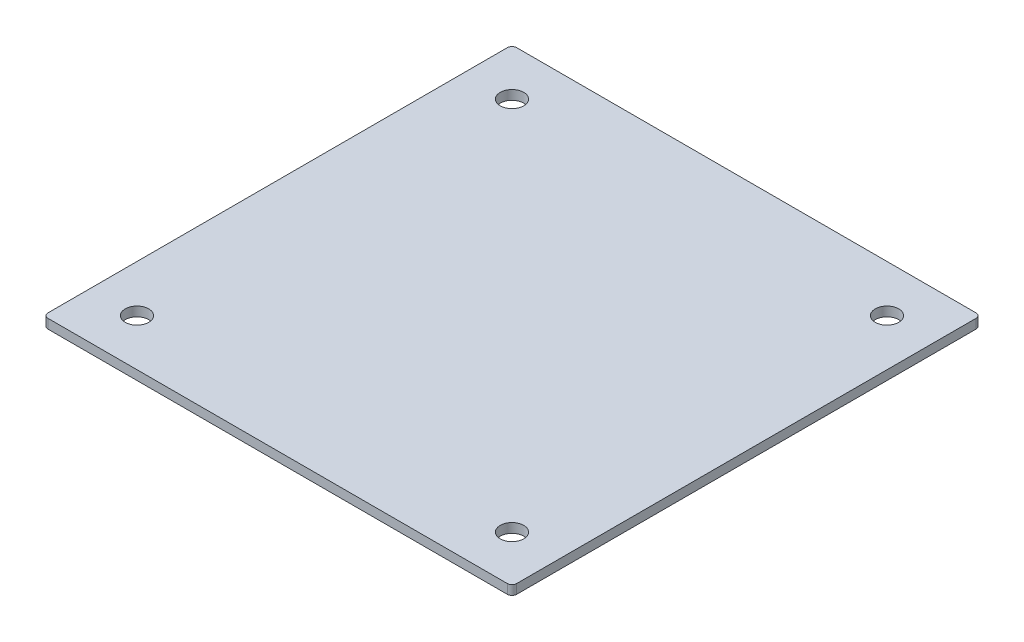
ISO-10303-21;
HEADER;
FILE_DESCRIPTION(('STEP AP214'),'2;1');
FILE_NAME('part.step','',(''),(''),'','','');
FILE_SCHEMA(('AUTOMOTIVE_DESIGN { 1 0 10303 214 1 1 1 1 }'));
ENDSEC;
DATA;
#1=APPLICATION_CONTEXT('core data for automotive mechanical design processes');
#2=APPLICATION_PROTOCOL_DEFINITION('international standard','automotive_design',2000,#1);
#3=PRODUCT_CONTEXT('',#1,'mechanical');
#4=PRODUCT('Part','Part','',(#3));
#5=PRODUCT_RELATED_PRODUCT_CATEGORY('part','',(#4));
#6=PRODUCT_DEFINITION_FORMATION('','',#4);
#7=PRODUCT_DEFINITION_CONTEXT('part definition',#1,'design');
#8=PRODUCT_DEFINITION('design','',#6,#7);
#9=PRODUCT_DEFINITION_SHAPE('','',#8);
#10=(LENGTH_UNIT() NAMED_UNIT(*) SI_UNIT(.MILLI.,.METRE.));
#11=(NAMED_UNIT(*) PLANE_ANGLE_UNIT() SI_UNIT($,.RADIAN.));
#12=(NAMED_UNIT(*) SI_UNIT($,.STERADIAN.) SOLID_ANGLE_UNIT());
#13=UNCERTAINTY_MEASURE_WITH_UNIT(LENGTH_MEASURE(1.E-05),#10,'distance_accuracy_value','');
#14=(GEOMETRIC_REPRESENTATION_CONTEXT(3) GLOBAL_UNCERTAINTY_ASSIGNED_CONTEXT((#13)) GLOBAL_UNIT_ASSIGNED_CONTEXT((#10,
#11,#12)) REPRESENTATION_CONTEXT('',''));
#15=CARTESIAN_POINT('',(0.,0.,0.));
#16=DIRECTION('',(0.,0.,1.));
#17=DIRECTION('',(1.,0.,0.));
#18=AXIS2_PLACEMENT_3D('',#15,#16,#17);
#19=CARTESIAN_POINT('',(-98.,4.,98.));
#20=DIRECTION('',(0.,1.,0.));
#21=DIRECTION('',(0.,0.,1.));
#22=AXIS2_PLACEMENT_3D('',#19,#20,#21);
#23=PLANE('',#22);
#24=CARTESIAN_POINT('',(79.9999999999994,4.,-80.));
#25=DIRECTION('',(0.,1.,0.));
#26=DIRECTION('',(0.,0.,1.));
#27=AXIS2_PLACEMENT_3D('',#24,#25,#26);
#28=CIRCLE('',#27,5.00000000000001);
#29=CARTESIAN_POINT('',(79.9999999999994,4.,-75.));
#30=VERTEX_POINT('',#29);
#31=EDGE_CURVE('E188',#30,#30,#28,.T.);
#32=ORIENTED_EDGE('',*,*,#31,.F.);
#33=EDGE_LOOP('',(#32));
#34=FACE_BOUND('',#33,.T.);
#35=CARTESIAN_POINT('',(-80.,4.,80.));
#36=DIRECTION('',(0.,1.,0.));
#37=DIRECTION('',(0.,0.,1.));
#38=AXIS2_PLACEMENT_3D('',#35,#36,#37);
#39=CIRCLE('',#38,5.00000000000001);
#40=CARTESIAN_POINT('',(-80.,4.,85.));
#41=VERTEX_POINT('',#40);
#42=EDGE_CURVE('E134',#41,#41,#39,.T.);
#43=ORIENTED_EDGE('',*,*,#42,.F.);
#44=EDGE_LOOP('',(#43));
#45=FACE_BOUND('',#44,.T.);
#46=CARTESIAN_POINT('',(-98.,4.,98.));
#47=DIRECTION('',(0.,1.,0.));
#48=DIRECTION('',(0.,0.,1.));
#49=AXIS2_PLACEMENT_3D('',#46,#47,#48);
#50=CIRCLE('',#49,2.);
#51=CARTESIAN_POINT('',(-100.,4.,98.));
#52=VERTEX_POINT('',#51);
#53=CARTESIAN_POINT('',(-98.,4.,100.));
#54=VERTEX_POINT('',#53);
#55=EDGE_CURVE('E145',#52,#54,#50,.T.);
#56=ORIENTED_EDGE('',*,*,#55,.T.);
#57=DIRECTION('',(1.,0.,0.));
#58=VECTOR('',#57,1.);
#59=CARTESIAN_POINT('',(-98.,4.,100.));
#60=LINE('',#59,#58);
#61=CARTESIAN_POINT('',(98.,4.,100.));
#62=VERTEX_POINT('',#61);
#63=EDGE_CURVE('E93',#54,#62,#60,.T.);
#64=ORIENTED_EDGE('',*,*,#63,.T.);
#65=CARTESIAN_POINT('',(98.,4.,98.));
#66=DIRECTION('',(0.,1.,0.));
#67=DIRECTION('',(0.,0.,1.));
#68=AXIS2_PLACEMENT_3D('',#65,#66,#67);
#69=CIRCLE('',#68,2.);
#70=CARTESIAN_POINT('',(100.,4.,98.));
#71=VERTEX_POINT('',#70);
#72=EDGE_CURVE('E160',#62,#71,#69,.T.);
#73=ORIENTED_EDGE('',*,*,#72,.T.);
#74=DIRECTION('',(0.,0.,-1.));
#75=VECTOR('',#74,1.);
#76=CARTESIAN_POINT('',(100.,4.,98.));
#77=LINE('',#76,#75);
#78=CARTESIAN_POINT('',(100.,4.,-98.));
#79=VERTEX_POINT('',#78);
#80=EDGE_CURVE('E173',#71,#79,#77,.T.);
#81=ORIENTED_EDGE('',*,*,#80,.T.);
#82=CARTESIAN_POINT('',(98.,4.,-98.));
#83=DIRECTION('',(0.,1.,0.));
#84=DIRECTION('',(0.,0.,1.));
#85=AXIS2_PLACEMENT_3D('',#82,#83,#84);
#86=CIRCLE('',#85,2.);
#87=CARTESIAN_POINT('',(98.,4.,-100.));
#88=VERTEX_POINT('',#87);
#89=EDGE_CURVE('E112',#79,#88,#86,.T.);
#90=ORIENTED_EDGE('',*,*,#89,.T.);
#91=DIRECTION('',(-1.,0.,0.));
#92=VECTOR('',#91,1.);
#93=CARTESIAN_POINT('',(-98.,4.,-100.));
#94=LINE('',#93,#92);
#95=CARTESIAN_POINT('',(-98.,4.,-100.));
#96=VERTEX_POINT('',#95);
#97=EDGE_CURVE('E106',#88,#96,#94,.T.);
#98=ORIENTED_EDGE('',*,*,#97,.T.);
#99=CARTESIAN_POINT('',(-98.,4.,-98.));
#100=DIRECTION('',(0.,1.,0.));
#101=DIRECTION('',(0.,0.,-1.));
#102=AXIS2_PLACEMENT_3D('',#99,#100,#101);
#103=CIRCLE('',#102,2.);
#104=CARTESIAN_POINT('',(-100.,4.,-98.));
#105=VERTEX_POINT('',#104);
#106=EDGE_CURVE('E110',#96,#105,#103,.T.);
#107=ORIENTED_EDGE('',*,*,#106,.T.);
#108=DIRECTION('',(0.,0.,1.));
#109=VECTOR('',#108,1.);
#110=CARTESIAN_POINT('',(-100.,4.,98.));
#111=LINE('',#110,#109);
#112=EDGE_CURVE('E50',#105,#52,#111,.T.);
#113=ORIENTED_EDGE('',*,*,#112,.T.);
#114=EDGE_LOOP('',(#56,#64,#73,#81,#90,#98,#107,#113));
#115=FACE_BOUND('',#114,.T.);
#116=CARTESIAN_POINT('',(80.,4.,80.));
#117=DIRECTION('',(0.,1.,0.));
#118=DIRECTION('',(0.,0.,1.));
#119=AXIS2_PLACEMENT_3D('',#116,#117,#118);
#120=CIRCLE('',#119,5.00000000000001);
#121=CARTESIAN_POINT('',(80.,4.,85.));
#122=VERTEX_POINT('',#121);
#123=EDGE_CURVE('E182',#122,#122,#120,.T.);
#124=ORIENTED_EDGE('',*,*,#123,.F.);
#125=EDGE_LOOP('',(#124));
#126=FACE_BOUND('',#125,.T.);
#127=CARTESIAN_POINT('',(-80.0000000000006,4.,-80.));
#128=DIRECTION('',(0.,1.,0.));
#129=DIRECTION('',(0.,0.,1.));
#130=AXIS2_PLACEMENT_3D('',#127,#128,#129);
#131=CIRCLE('',#130,5.00000000000001);
#132=CARTESIAN_POINT('',(-80.0000000000006,4.,-75.));
#133=VERTEX_POINT('',#132);
#134=EDGE_CURVE('E194',#133,#133,#131,.T.);
#135=ORIENTED_EDGE('',*,*,#134,.F.);
#136=EDGE_LOOP('',(#135));
#137=FACE_BOUND('',#136,.T.);
#138=ADVANCED_FACE('F33',(#34,#45,#115,#126,#137),#23,.T.);
#139=CARTESIAN_POINT('',(-98.,0.,98.));
#140=DIRECTION('',(0.,1.,0.));
#141=DIRECTION('',(0.,0.,1.));
#142=AXIS2_PLACEMENT_3D('',#139,#140,#141);
#143=PLANE('',#142);
#144=CARTESIAN_POINT('',(-98.,0.,98.));
#145=DIRECTION('',(0.,1.,0.));
#146=DIRECTION('',(0.,0.,1.));
#147=AXIS2_PLACEMENT_3D('',#144,#145,#146);
#148=CIRCLE('',#147,2.);
#149=CARTESIAN_POINT('',(-100.,0.,98.));
#150=VERTEX_POINT('',#149);
#151=CARTESIAN_POINT('',(-98.,0.,100.));
#152=VERTEX_POINT('',#151);
#153=EDGE_CURVE('E130',#150,#152,#148,.T.);
#154=ORIENTED_EDGE('',*,*,#153,.F.);
#155=DIRECTION('',(0.,0.,1.));
#156=VECTOR('',#155,1.);
#157=CARTESIAN_POINT('',(-100.,0.,98.));
#158=LINE('',#157,#156);
#159=CARTESIAN_POINT('',(-100.,0.,-98.));
#160=VERTEX_POINT('',#159);
#161=EDGE_CURVE('E85',#160,#150,#158,.T.);
#162=ORIENTED_EDGE('',*,*,#161,.F.);
#163=CARTESIAN_POINT('',(-98.,0.,-98.));
#164=DIRECTION('',(0.,1.,0.));
#165=DIRECTION('',(0.,0.,-1.));
#166=AXIS2_PLACEMENT_3D('',#163,#164,#165);
#167=CIRCLE('',#166,2.);
#168=CARTESIAN_POINT('',(-98.,0.,-100.));
#169=VERTEX_POINT('',#168);
#170=EDGE_CURVE('E79',#169,#160,#167,.T.);
#171=ORIENTED_EDGE('',*,*,#170,.F.);
#172=DIRECTION('',(-1.,0.,0.));
#173=VECTOR('',#172,1.);
#174=CARTESIAN_POINT('',(-98.,0.,-100.));
#175=LINE('',#174,#173);
#176=CARTESIAN_POINT('',(98.,0.,-100.));
#177=VERTEX_POINT('',#176);
#178=EDGE_CURVE('E120',#177,#169,#175,.T.);
#179=ORIENTED_EDGE('',*,*,#178,.F.);
#180=CARTESIAN_POINT('',(98.,0.,-98.));
#181=DIRECTION('',(0.,1.,0.));
#182=DIRECTION('',(0.,0.,1.));
#183=AXIS2_PLACEMENT_3D('',#180,#181,#182);
#184=CIRCLE('',#183,2.);
#185=CARTESIAN_POINT('',(100.,0.,-98.));
#186=VERTEX_POINT('',#185);
#187=EDGE_CURVE('E140',#186,#177,#184,.T.);
#188=ORIENTED_EDGE('',*,*,#187,.F.);
#189=DIRECTION('',(0.,0.,-1.));
#190=VECTOR('',#189,1.);
#191=CARTESIAN_POINT('',(100.,0.,98.));
#192=LINE('',#191,#190);
#193=CARTESIAN_POINT('',(100.,0.,98.));
#194=VERTEX_POINT('',#193);
#195=EDGE_CURVE('E138',#194,#186,#192,.T.);
#196=ORIENTED_EDGE('',*,*,#195,.F.);
#197=CARTESIAN_POINT('',(98.,0.,98.));
#198=DIRECTION('',(0.,1.,0.));
#199=DIRECTION('',(0.,0.,1.));
#200=AXIS2_PLACEMENT_3D('',#197,#198,#199);
#201=CIRCLE('',#200,2.);
#202=CARTESIAN_POINT('',(98.,0.,100.));
#203=VERTEX_POINT('',#202);
#204=EDGE_CURVE('E136',#203,#194,#201,.T.);
#205=ORIENTED_EDGE('',*,*,#204,.F.);
#206=DIRECTION('',(1.,0.,0.));
#207=VECTOR('',#206,1.);
#208=CARTESIAN_POINT('',(-98.,0.,100.));
#209=LINE('',#208,#207);
#210=EDGE_CURVE('E133',#152,#203,#209,.T.);
#211=ORIENTED_EDGE('',*,*,#210,.F.);
#212=EDGE_LOOP('',(#154,#162,#171,#179,#188,#196,#205,#211));
#213=FACE_BOUND('',#212,.T.);
#214=CARTESIAN_POINT('',(-80.,0.,80.));
#215=DIRECTION('',(0.,1.,0.));
#216=DIRECTION('',(0.,0.,1.));
#217=AXIS2_PLACEMENT_3D('',#214,#215,#216);
#218=CIRCLE('',#217,5.00000000000001);
#219=CARTESIAN_POINT('',(-80.,0.,85.));
#220=VERTEX_POINT('',#219);
#221=EDGE_CURVE('E179',#220,#220,#218,.T.);
#222=ORIENTED_EDGE('',*,*,#221,.T.);
#223=EDGE_LOOP('',(#222));
#224=FACE_BOUND('',#223,.T.);
#225=CARTESIAN_POINT('',(80.,0.,80.));
#226=DIRECTION('',(0.,1.,0.));
#227=DIRECTION('',(0.,0.,1.));
#228=AXIS2_PLACEMENT_3D('',#225,#226,#227);
#229=CIRCLE('',#228,5.00000000000001);
#230=CARTESIAN_POINT('',(80.,0.,85.));
#231=VERTEX_POINT('',#230);
#232=EDGE_CURVE('E185',#231,#231,#229,.T.);
#233=ORIENTED_EDGE('',*,*,#232,.T.);
#234=EDGE_LOOP('',(#233));
#235=FACE_BOUND('',#234,.T.);
#236=CARTESIAN_POINT('',(79.9999999999994,0.,-80.));
#237=DIRECTION('',(0.,1.,0.));
#238=DIRECTION('',(0.,0.,1.));
#239=AXIS2_PLACEMENT_3D('',#236,#237,#238);
#240=CIRCLE('',#239,5.00000000000001);
#241=CARTESIAN_POINT('',(79.9999999999994,0.,-75.));
#242=VERTEX_POINT('',#241);
#243=EDGE_CURVE('E191',#242,#242,#240,.T.);
#244=ORIENTED_EDGE('',*,*,#243,.T.);
#245=EDGE_LOOP('',(#244));
#246=FACE_BOUND('',#245,.T.);
#247=CARTESIAN_POINT('',(-80.0000000000006,0.,-80.));
#248=DIRECTION('',(0.,1.,0.));
#249=DIRECTION('',(0.,0.,1.));
#250=AXIS2_PLACEMENT_3D('',#247,#248,#249);
#251=CIRCLE('',#250,5.00000000000001);
#252=CARTESIAN_POINT('',(-80.0000000000006,0.,-75.));
#253=VERTEX_POINT('',#252);
#254=EDGE_CURVE('E197',#253,#253,#251,.T.);
#255=ORIENTED_EDGE('',*,*,#254,.T.);
#256=EDGE_LOOP('',(#255));
#257=FACE_BOUND('',#256,.T.);
#258=ADVANCED_FACE('F164',(#213,#224,#235,#246,#257),#143,.F.);
#259=CARTESIAN_POINT('',(-98.,4.,98.));
#260=DIRECTION('',(0.,-1.,0.));
#261=DIRECTION('',(0.,0.,-1.));
#262=AXIS2_PLACEMENT_3D('',#259,#260,#261);
#263=CYLINDRICAL_SURFACE('',#262,2.);
#264=ORIENTED_EDGE('',*,*,#153,.T.);
#265=DIRECTION('',(0.,-1.,0.));
#266=VECTOR('',#265,1.);
#267=CARTESIAN_POINT('',(-98.,4.,100.));
#268=LINE('',#267,#266);
#269=EDGE_CURVE('E11',#54,#152,#268,.T.);
#270=ORIENTED_EDGE('',*,*,#269,.F.);
#271=ORIENTED_EDGE('',*,*,#55,.F.);
#272=DIRECTION('',(0.,-1.,0.));
#273=VECTOR('',#272,1.);
#274=CARTESIAN_POINT('',(-100.,4.,98.));
#275=LINE('',#274,#273);
#276=EDGE_CURVE('E126',#52,#150,#275,.T.);
#277=ORIENTED_EDGE('',*,*,#276,.T.);
#278=EDGE_LOOP('',(#264,#270,#271,#277));
#279=FACE_BOUND('',#278,.T.);
#280=ADVANCED_FACE('F35',(#279),#263,.T.);
#281=CARTESIAN_POINT('',(-98.,4.,100.));
#282=DIRECTION('',(0.,0.,-1.));
#283=DIRECTION('',(-1.,0.,0.));
#284=AXIS2_PLACEMENT_3D('',#281,#282,#283);
#285=PLANE('',#284);
#286=ORIENTED_EDGE('',*,*,#210,.T.);
#287=DIRECTION('',(0.,-1.,0.));
#288=VECTOR('',#287,1.);
#289=CARTESIAN_POINT('',(98.,4.,100.));
#290=LINE('',#289,#288);
#291=EDGE_CURVE('E42',#62,#203,#290,.T.);
#292=ORIENTED_EDGE('',*,*,#291,.F.);
#293=ORIENTED_EDGE('',*,*,#63,.F.);
#294=ORIENTED_EDGE('',*,*,#269,.T.);
#295=EDGE_LOOP('',(#286,#292,#293,#294));
#296=FACE_BOUND('',#295,.T.);
#297=ADVANCED_FACE('F231',(#296),#285,.F.);
#298=CARTESIAN_POINT('',(98.,4.,98.));
#299=DIRECTION('',(0.,-1.,0.));
#300=DIRECTION('',(0.,0.,-1.));
#301=AXIS2_PLACEMENT_3D('',#298,#299,#300);
#302=CYLINDRICAL_SURFACE('',#301,2.);
#303=ORIENTED_EDGE('',*,*,#204,.T.);
#304=DIRECTION('',(0.,-1.,0.));
#305=VECTOR('',#304,1.);
#306=CARTESIAN_POINT('',(100.,4.,98.));
#307=LINE('',#306,#305);
#308=EDGE_CURVE('E152',#71,#194,#307,.T.);
#309=ORIENTED_EDGE('',*,*,#308,.F.);
#310=ORIENTED_EDGE('',*,*,#72,.F.);
#311=ORIENTED_EDGE('',*,*,#291,.T.);
#312=EDGE_LOOP('',(#303,#309,#310,#311));
#313=FACE_BOUND('',#312,.T.);
#314=ADVANCED_FACE('F158',(#313),#302,.T.);
#315=CARTESIAN_POINT('',(100.,4.,98.));
#316=DIRECTION('',(-1.,0.,0.));
#317=DIRECTION('',(0.,0.,1.));
#318=AXIS2_PLACEMENT_3D('',#315,#316,#317);
#319=PLANE('',#318);
#320=ORIENTED_EDGE('',*,*,#195,.T.);
#321=DIRECTION('',(0.,-1.,0.));
#322=VECTOR('',#321,1.);
#323=CARTESIAN_POINT('',(100.,4.,-98.));
#324=LINE('',#323,#322);
#325=EDGE_CURVE('E149',#79,#186,#324,.T.);
#326=ORIENTED_EDGE('',*,*,#325,.F.);
#327=ORIENTED_EDGE('',*,*,#80,.F.);
#328=ORIENTED_EDGE('',*,*,#308,.T.);
#329=EDGE_LOOP('',(#320,#326,#327,#328));
#330=FACE_BOUND('',#329,.T.);
#331=ADVANCED_FACE('F169',(#330),#319,.F.);
#332=CARTESIAN_POINT('',(98.,4.,-98.));
#333=DIRECTION('',(0.,-1.,0.));
#334=DIRECTION('',(0.,0.,-1.));
#335=AXIS2_PLACEMENT_3D('',#332,#333,#334);
#336=CYLINDRICAL_SURFACE('',#335,2.);
#337=ORIENTED_EDGE('',*,*,#187,.T.);
#338=DIRECTION('',(0.,-1.,0.));
#339=VECTOR('',#338,1.);
#340=CARTESIAN_POINT('',(98.,4.,-100.));
#341=LINE('',#340,#339);
#342=EDGE_CURVE('E121',#88,#177,#341,.T.);
#343=ORIENTED_EDGE('',*,*,#342,.F.);
#344=ORIENTED_EDGE('',*,*,#89,.F.);
#345=ORIENTED_EDGE('',*,*,#325,.T.);
#346=EDGE_LOOP('',(#337,#343,#344,#345));
#347=FACE_BOUND('',#346,.T.);
#348=ADVANCED_FACE('F172',(#347),#336,.T.);
#349=CARTESIAN_POINT('',(-98.,4.,-100.));
#350=DIRECTION('',(0.,0.,1.));
#351=DIRECTION('',(1.,0.,0.));
#352=AXIS2_PLACEMENT_3D('',#349,#350,#351);
#353=PLANE('',#352);
#354=ORIENTED_EDGE('',*,*,#178,.T.);
#355=DIRECTION('',(0.,-1.,0.));
#356=VECTOR('',#355,1.);
#357=CARTESIAN_POINT('',(-98.,4.,-100.));
#358=LINE('',#357,#356);
#359=EDGE_CURVE('E117',#96,#169,#358,.T.);
#360=ORIENTED_EDGE('',*,*,#359,.F.);
#361=ORIENTED_EDGE('',*,*,#97,.F.);
#362=ORIENTED_EDGE('',*,*,#342,.T.);
#363=EDGE_LOOP('',(#354,#360,#361,#362));
#364=FACE_BOUND('',#363,.T.);
#365=ADVANCED_FACE('F118',(#364),#353,.F.);
#366=CARTESIAN_POINT('',(-98.,4.,-98.));
#367=DIRECTION('',(0.,-1.,0.));
#368=DIRECTION('',(0.,0.,-1.));
#369=AXIS2_PLACEMENT_3D('',#366,#367,#368);
#370=CYLINDRICAL_SURFACE('',#369,2.);
#371=ORIENTED_EDGE('',*,*,#170,.T.);
#372=DIRECTION('',(0.,-1.,0.));
#373=VECTOR('',#372,1.);
#374=CARTESIAN_POINT('',(-100.,4.,-98.));
#375=LINE('',#374,#373);
#376=EDGE_CURVE('E122',#105,#160,#375,.T.);
#377=ORIENTED_EDGE('',*,*,#376,.F.);
#378=ORIENTED_EDGE('',*,*,#106,.F.);
#379=ORIENTED_EDGE('',*,*,#359,.T.);
#380=EDGE_LOOP('',(#371,#377,#378,#379));
#381=FACE_BOUND('',#380,.T.);
#382=ADVANCED_FACE('F124',(#381),#370,.T.);
#383=CARTESIAN_POINT('',(-100.,4.,98.));
#384=DIRECTION('',(1.,0.,0.));
#385=DIRECTION('',(0.,0.,-1.));
#386=AXIS2_PLACEMENT_3D('',#383,#384,#385);
#387=PLANE('',#386);
#388=ORIENTED_EDGE('',*,*,#161,.T.);
#389=ORIENTED_EDGE('',*,*,#276,.F.);
#390=ORIENTED_EDGE('',*,*,#112,.F.);
#391=ORIENTED_EDGE('',*,*,#376,.T.);
#392=EDGE_LOOP('',(#388,#389,#390,#391));
#393=FACE_BOUND('',#392,.T.);
#394=ADVANCED_FACE('F219',(#393),#387,.F.);
#395=CARTESIAN_POINT('',(-80.,4.,80.));
#396=DIRECTION('',(0.,-1.,0.));
#397=DIRECTION('',(0.,0.,-1.));
#398=AXIS2_PLACEMENT_3D('',#395,#396,#397);
#399=CYLINDRICAL_SURFACE('',#398,5.00000000000001);
#400=ORIENTED_EDGE('',*,*,#42,.T.);
#401=EDGE_LOOP('',(#400));
#402=FACE_BOUND('',#401,.T.);
#403=ORIENTED_EDGE('',*,*,#221,.F.);
#404=EDGE_LOOP('',(#403));
#405=FACE_BOUND('',#404,.T.);
#406=ADVANCED_FACE('F216',(#402,#405),#399,.F.);
#407=CARTESIAN_POINT('',(80.,4.,80.));
#408=DIRECTION('',(0.,-1.,0.));
#409=DIRECTION('',(0.,0.,-1.));
#410=AXIS2_PLACEMENT_3D('',#407,#408,#409);
#411=CYLINDRICAL_SURFACE('',#410,5.00000000000001);
#412=ORIENTED_EDGE('',*,*,#123,.T.);
#413=EDGE_LOOP('',(#412));
#414=FACE_BOUND('',#413,.T.);
#415=ORIENTED_EDGE('',*,*,#232,.F.);
#416=EDGE_LOOP('',(#415));
#417=FACE_BOUND('',#416,.T.);
#418=ADVANCED_FACE('F295',(#414,#417),#411,.F.);
#419=CARTESIAN_POINT('',(79.9999999999994,4.,-80.));
#420=DIRECTION('',(0.,-1.,0.));
#421=DIRECTION('',(0.,0.,-1.));
#422=AXIS2_PLACEMENT_3D('',#419,#420,#421);
#423=CYLINDRICAL_SURFACE('',#422,5.00000000000001);
#424=ORIENTED_EDGE('',*,*,#31,.T.);
#425=EDGE_LOOP('',(#424));
#426=FACE_BOUND('',#425,.T.);
#427=ORIENTED_EDGE('',*,*,#243,.F.);
#428=EDGE_LOOP('',(#427));
#429=FACE_BOUND('',#428,.T.);
#430=ADVANCED_FACE('F303',(#426,#429),#423,.F.);
#431=CARTESIAN_POINT('',(-80.0000000000006,4.,-80.));
#432=DIRECTION('',(0.,-1.,0.));
#433=DIRECTION('',(0.,0.,-1.));
#434=AXIS2_PLACEMENT_3D('',#431,#432,#433);
#435=CYLINDRICAL_SURFACE('',#434,5.00000000000001);
#436=ORIENTED_EDGE('',*,*,#134,.T.);
#437=EDGE_LOOP('',(#436));
#438=FACE_BOUND('',#437,.T.);
#439=ORIENTED_EDGE('',*,*,#254,.F.);
#440=EDGE_LOOP('',(#439));
#441=FACE_BOUND('',#440,.T.);
#442=ADVANCED_FACE('F203',(#438,#441),#435,.F.);
#443=CLOSED_SHELL('',(#138,#258,#280,#297,#314,#331,#348,#365,#382,#394,#406,#418,#430,#442));
#444=MANIFOLD_SOLID_BREP('B2',#443);
#445=ADVANCED_BREP_SHAPE_REPRESENTATION('',(#18,#444),#14);
#446=SHAPE_DEFINITION_REPRESENTATION(#9,#445);
ENDSEC;
END-ISO-10303-21;
